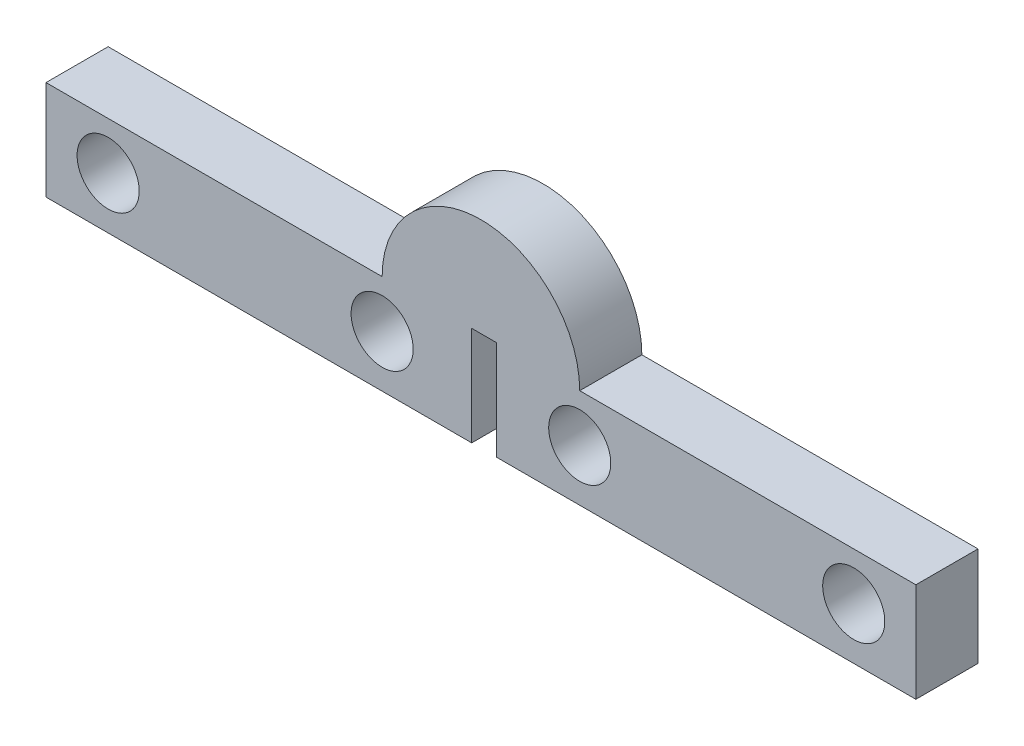
ISO-10303-21;
HEADER;
FILE_DESCRIPTION(('STEP AP214'),'2;1');
FILE_NAME('part.step','',(''),(''),'','','');
FILE_SCHEMA(('AUTOMOTIVE_DESIGN { 1 0 10303 214 1 1 1 1 }'));
ENDSEC;
DATA;
#1=APPLICATION_CONTEXT('core data for automotive mechanical design processes');
#2=APPLICATION_PROTOCOL_DEFINITION('international standard','automotive_design',2000,#1);
#3=PRODUCT_CONTEXT('',#1,'mechanical');
#4=PRODUCT('Part','Part','',(#3));
#5=PRODUCT_RELATED_PRODUCT_CATEGORY('part','',(#4));
#6=PRODUCT_DEFINITION_FORMATION('','',#4);
#7=PRODUCT_DEFINITION_CONTEXT('part definition',#1,'design');
#8=PRODUCT_DEFINITION('design','',#6,#7);
#9=PRODUCT_DEFINITION_SHAPE('','',#8);
#10=(LENGTH_UNIT() NAMED_UNIT(*) SI_UNIT(.MILLI.,.METRE.));
#11=(NAMED_UNIT(*) PLANE_ANGLE_UNIT() SI_UNIT($,.RADIAN.));
#12=(NAMED_UNIT(*) SI_UNIT($,.STERADIAN.) SOLID_ANGLE_UNIT());
#13=UNCERTAINTY_MEASURE_WITH_UNIT(LENGTH_MEASURE(1.E-05),#10,'distance_accuracy_value','');
#14=(GEOMETRIC_REPRESENTATION_CONTEXT(3) GLOBAL_UNCERTAINTY_ASSIGNED_CONTEXT((#13)) GLOBAL_UNIT_ASSIGNED_CONTEXT((#10,
#11,#12)) REPRESENTATION_CONTEXT('',''));
#15=CARTESIAN_POINT('',(0.,0.,0.));
#16=DIRECTION('',(0.,0.,1.));
#17=DIRECTION('',(1.,0.,0.));
#18=AXIS2_PLACEMENT_3D('',#15,#16,#17);
#19=CARTESIAN_POINT('',(21.,4.79,3.));
#20=DIRECTION('',(0.,0.,1.));
#21=DIRECTION('',(1.,0.,0.));
#22=AXIS2_PLACEMENT_3D('',#19,#20,#21);
#23=PLANE('',#22);
#24=DIRECTION('',(0.,1.,0.));
#25=VECTOR('',#24,1.);
#26=CARTESIAN_POINT('',(21.745,0.,3.));
#27=LINE('',#26,#25);
#28=CARTESIAN_POINT('',(21.745,0.,3.));
#29=VERTEX_POINT('',#28);
#30=CARTESIAN_POINT('',(21.745,4.79,3.));
#31=VERTEX_POINT('',#30);
#32=EDGE_CURVE('E181',#29,#31,#27,.T.);
#33=ORIENTED_EDGE('',*,*,#32,.F.);
#34=DIRECTION('',(-1.,0.,0.));
#35=VECTOR('',#34,1.);
#36=CARTESIAN_POINT('',(42.,0.,3.));
#37=LINE('',#36,#35);
#38=CARTESIAN_POINT('',(42.,0.,3.));
#39=VERTEX_POINT('',#38);
#40=EDGE_CURVE('E215',#39,#29,#37,.T.);
#41=ORIENTED_EDGE('',*,*,#40,.F.);
#42=DIRECTION('',(0.,-1.,0.));
#43=VECTOR('',#42,1.);
#44=CARTESIAN_POINT('',(42.,0.,3.));
#45=LINE('',#44,#43);
#46=CARTESIAN_POINT('',(42.,4.79,3.));
#47=VERTEX_POINT('',#46);
#48=EDGE_CURVE('E206',#47,#39,#45,.T.);
#49=ORIENTED_EDGE('',*,*,#48,.F.);
#50=DIRECTION('',(1.,0.,0.));
#51=VECTOR('',#50,1.);
#52=CARTESIAN_POINT('',(42.,4.79,3.));
#53=LINE('',#52,#51);
#54=CARTESIAN_POINT('',(25.77,4.79,3.));
#55=VERTEX_POINT('',#54);
#56=EDGE_CURVE('E210',#55,#47,#53,.T.);
#57=ORIENTED_EDGE('',*,*,#56,.F.);
#58=CARTESIAN_POINT('',(21.,4.79,3.));
#59=DIRECTION('',(0.,0.,1.));
#60=DIRECTION('',(1.,0.,0.));
#61=AXIS2_PLACEMENT_3D('',#58,#59,#60);
#62=CIRCLE('',#61,4.76999999999999);
#63=CARTESIAN_POINT('',(16.23,4.79,3.));
#64=VERTEX_POINT('',#63);
#65=EDGE_CURVE('E132',#55,#64,#62,.T.);
#66=ORIENTED_EDGE('',*,*,#65,.T.);
#67=DIRECTION('',(-1.,0.,0.));
#68=VECTOR('',#67,1.);
#69=CARTESIAN_POINT('',(0.,4.79,3.));
#70=LINE('',#69,#68);
#71=CARTESIAN_POINT('',(0.,4.79,3.));
#72=VERTEX_POINT('',#71);
#73=EDGE_CURVE('E63',#64,#72,#70,.T.);
#74=ORIENTED_EDGE('',*,*,#73,.T.);
#75=DIRECTION('',(0.,-1.,0.));
#76=VECTOR('',#75,1.);
#77=CARTESIAN_POINT('',(0.,0.,3.));
#78=LINE('',#77,#76);
#79=CARTESIAN_POINT('',(0.,0.,3.));
#80=VERTEX_POINT('',#79);
#81=EDGE_CURVE('E159',#72,#80,#78,.T.);
#82=ORIENTED_EDGE('',*,*,#81,.T.);
#83=DIRECTION('',(1.,0.,0.));
#84=VECTOR('',#83,1.);
#85=CARTESIAN_POINT('',(0.,0.,3.));
#86=LINE('',#85,#84);
#87=CARTESIAN_POINT('',(20.555,0.,3.));
#88=VERTEX_POINT('',#87);
#89=EDGE_CURVE('E96',#80,#88,#86,.T.);
#90=ORIENTED_EDGE('',*,*,#89,.T.);
#91=DIRECTION('',(0.,1.,0.));
#92=VECTOR('',#91,1.);
#93=CARTESIAN_POINT('',(20.555,4.79,3.));
#94=LINE('',#93,#92);
#95=CARTESIAN_POINT('',(20.555,4.79,3.));
#96=VERTEX_POINT('',#95);
#97=EDGE_CURVE('E104',#88,#96,#94,.T.);
#98=ORIENTED_EDGE('',*,*,#97,.T.);
#99=DIRECTION('',(1.,0.,0.));
#100=VECTOR('',#99,1.);
#101=CARTESIAN_POINT('',(20.555,4.79,3.));
#102=LINE('',#101,#100);
#103=EDGE_CURVE('E110',#96,#31,#102,.T.);
#104=ORIENTED_EDGE('',*,*,#103,.T.);
#105=EDGE_LOOP('',(#33,#41,#49,#57,#66,#74,#82,#90,#98,#104));
#106=FACE_BOUND('',#105,.T.);
#107=CARTESIAN_POINT('',(3.,2.5,3.));
#108=DIRECTION('',(0.,0.,1.));
#109=DIRECTION('',(1.,0.,0.));
#110=AXIS2_PLACEMENT_3D('',#107,#108,#109);
#111=CIRCLE('',#110,1.5);
#112=CARTESIAN_POINT('',(4.5,2.5,3.));
#113=VERTEX_POINT('',#112);
#114=EDGE_CURVE('E146',#113,#113,#111,.T.);
#115=ORIENTED_EDGE('',*,*,#114,.F.);
#116=EDGE_LOOP('',(#115));
#117=FACE_BOUND('',#116,.T.);
#118=CARTESIAN_POINT('',(16.23,2.5,3.));
#119=DIRECTION('',(0.,0.,1.));
#120=DIRECTION('',(1.,0.,0.));
#121=AXIS2_PLACEMENT_3D('',#118,#119,#120);
#122=CIRCLE('',#121,1.5);
#123=CARTESIAN_POINT('',(17.73,2.5,3.));
#124=VERTEX_POINT('',#123);
#125=EDGE_CURVE('E241',#124,#124,#122,.T.);
#126=ORIENTED_EDGE('',*,*,#125,.F.);
#127=EDGE_LOOP('',(#126));
#128=FACE_BOUND('',#127,.T.);
#129=CARTESIAN_POINT('',(25.77,2.5,3.));
#130=DIRECTION('',(0.,0.,-1.));
#131=DIRECTION('',(-1.,0.,0.));
#132=AXIS2_PLACEMENT_3D('',#129,#130,#131);
#133=CIRCLE('',#132,1.5);
#134=CARTESIAN_POINT('',(24.27,2.5,3.));
#135=VERTEX_POINT('',#134);
#136=EDGE_CURVE('E190',#135,#135,#133,.T.);
#137=ORIENTED_EDGE('',*,*,#136,.T.);
#138=EDGE_LOOP('',(#137));
#139=FACE_BOUND('',#138,.T.);
#140=CARTESIAN_POINT('',(39.,2.5,3.));
#141=DIRECTION('',(0.,0.,-1.));
#142=DIRECTION('',(-1.,0.,0.));
#143=AXIS2_PLACEMENT_3D('',#140,#141,#142);
#144=CIRCLE('',#143,1.5);
#145=CARTESIAN_POINT('',(37.5,2.5,3.));
#146=VERTEX_POINT('',#145);
#147=EDGE_CURVE('E198',#146,#146,#144,.T.);
#148=ORIENTED_EDGE('',*,*,#147,.T.);
#149=EDGE_LOOP('',(#148));
#150=FACE_BOUND('',#149,.T.);
#151=ADVANCED_FACE('F39',(#106,#117,#128,#139,#150),#23,.T.);
#152=CARTESIAN_POINT('',(21.,4.79,0.));
#153=DIRECTION('',(0.,0.,1.));
#154=DIRECTION('',(1.,0.,0.));
#155=AXIS2_PLACEMENT_3D('',#152,#153,#154);
#156=PLANE('',#155);
#157=DIRECTION('',(-1.,0.,0.));
#158=VECTOR('',#157,1.);
#159=CARTESIAN_POINT('',(42.,0.,0.));
#160=LINE('',#159,#158);
#161=CARTESIAN_POINT('',(42.,0.,0.));
#162=VERTEX_POINT('',#161);
#163=CARTESIAN_POINT('',(21.745,0.,0.));
#164=VERTEX_POINT('',#163);
#165=EDGE_CURVE('E211',#162,#164,#160,.T.);
#166=ORIENTED_EDGE('',*,*,#165,.T.);
#167=DIRECTION('',(0.,1.,0.));
#168=VECTOR('',#167,1.);
#169=CARTESIAN_POINT('',(21.745,4.79,0.));
#170=LINE('',#169,#168);
#171=CARTESIAN_POINT('',(21.745,4.79,0.));
#172=VERTEX_POINT('',#171);
#173=EDGE_CURVE('E54',#164,#172,#170,.T.);
#174=ORIENTED_EDGE('',*,*,#173,.T.);
#175=DIRECTION('',(1.,0.,0.));
#176=VECTOR('',#175,1.);
#177=CARTESIAN_POINT('',(20.555,4.79,0.));
#178=LINE('',#177,#176);
#179=CARTESIAN_POINT('',(20.555,4.79,0.));
#180=VERTEX_POINT('',#179);
#181=EDGE_CURVE('E151',#180,#172,#178,.T.);
#182=ORIENTED_EDGE('',*,*,#181,.F.);
#183=DIRECTION('',(0.,1.,0.));
#184=VECTOR('',#183,1.);
#185=CARTESIAN_POINT('',(20.555,4.79,0.));
#186=LINE('',#185,#184);
#187=CARTESIAN_POINT('',(20.555,0.,0.));
#188=VERTEX_POINT('',#187);
#189=EDGE_CURVE('E120',#188,#180,#186,.T.);
#190=ORIENTED_EDGE('',*,*,#189,.F.);
#191=DIRECTION('',(1.,0.,0.));
#192=VECTOR('',#191,1.);
#193=CARTESIAN_POINT('',(0.,0.,0.));
#194=LINE('',#193,#192);
#195=CARTESIAN_POINT('',(0.,0.,0.));
#196=VERTEX_POINT('',#195);
#197=EDGE_CURVE('E145',#196,#188,#194,.T.);
#198=ORIENTED_EDGE('',*,*,#197,.F.);
#199=DIRECTION('',(0.,-1.,0.));
#200=VECTOR('',#199,1.);
#201=CARTESIAN_POINT('',(0.,0.,0.));
#202=LINE('',#201,#200);
#203=CARTESIAN_POINT('',(0.,4.79,0.));
#204=VERTEX_POINT('',#203);
#205=EDGE_CURVE('E141',#204,#196,#202,.T.);
#206=ORIENTED_EDGE('',*,*,#205,.F.);
#207=DIRECTION('',(-1.,0.,0.));
#208=VECTOR('',#207,1.);
#209=CARTESIAN_POINT('',(0.,4.79,0.));
#210=LINE('',#209,#208);
#211=CARTESIAN_POINT('',(16.23,4.79,0.));
#212=VERTEX_POINT('',#211);
#213=EDGE_CURVE('E87',#212,#204,#210,.T.);
#214=ORIENTED_EDGE('',*,*,#213,.F.);
#215=CARTESIAN_POINT('',(21.,4.79,0.));
#216=DIRECTION('',(0.,0.,1.));
#217=DIRECTION('',(1.,0.,0.));
#218=AXIS2_PLACEMENT_3D('',#215,#216,#217);
#219=CIRCLE('',#218,4.76999999999999);
#220=CARTESIAN_POINT('',(25.77,4.79,0.));
#221=VERTEX_POINT('',#220);
#222=EDGE_CURVE('E154',#221,#212,#219,.T.);
#223=ORIENTED_EDGE('',*,*,#222,.F.);
#224=DIRECTION('',(1.,0.,0.));
#225=VECTOR('',#224,1.);
#226=CARTESIAN_POINT('',(42.,4.79,0.));
#227=LINE('',#226,#225);
#228=CARTESIAN_POINT('',(42.,4.79,0.));
#229=VERTEX_POINT('',#228);
#230=EDGE_CURVE('E223',#221,#229,#227,.T.);
#231=ORIENTED_EDGE('',*,*,#230,.T.);
#232=DIRECTION('',(0.,-1.,0.));
#233=VECTOR('',#232,1.);
#234=CARTESIAN_POINT('',(42.,0.,0.));
#235=LINE('',#234,#233);
#236=EDGE_CURVE('E202',#229,#162,#235,.T.);
#237=ORIENTED_EDGE('',*,*,#236,.T.);
#238=EDGE_LOOP('',(#166,#174,#182,#190,#198,#206,#214,#223,#231,#237));
#239=FACE_BOUND('',#238,.T.);
#240=CARTESIAN_POINT('',(3.,2.5,0.));
#241=DIRECTION('',(0.,0.,1.));
#242=DIRECTION('',(1.,0.,0.));
#243=AXIS2_PLACEMENT_3D('',#240,#241,#242);
#244=CIRCLE('',#243,1.5);
#245=CARTESIAN_POINT('',(4.5,2.5,0.));
#246=VERTEX_POINT('',#245);
#247=EDGE_CURVE('E245',#246,#246,#244,.T.);
#248=ORIENTED_EDGE('',*,*,#247,.T.);
#249=EDGE_LOOP('',(#248));
#250=FACE_BOUND('',#249,.T.);
#251=CARTESIAN_POINT('',(16.23,2.5,0.));
#252=DIRECTION('',(0.,0.,1.));
#253=DIRECTION('',(1.,0.,0.));
#254=AXIS2_PLACEMENT_3D('',#251,#252,#253);
#255=CIRCLE('',#254,1.5);
#256=CARTESIAN_POINT('',(17.73,2.5,0.));
#257=VERTEX_POINT('',#256);
#258=EDGE_CURVE('E240',#257,#257,#255,.T.);
#259=ORIENTED_EDGE('',*,*,#258,.T.);
#260=EDGE_LOOP('',(#259));
#261=FACE_BOUND('',#260,.T.);
#262=CARTESIAN_POINT('',(25.77,2.5,0.));
#263=DIRECTION('',(0.,0.,-1.));
#264=DIRECTION('',(-1.,0.,0.));
#265=AXIS2_PLACEMENT_3D('',#262,#263,#264);
#266=CIRCLE('',#265,1.5);
#267=CARTESIAN_POINT('',(24.27,2.5,0.));
#268=VERTEX_POINT('',#267);
#269=EDGE_CURVE('E186',#268,#268,#266,.T.);
#270=ORIENTED_EDGE('',*,*,#269,.F.);
#271=EDGE_LOOP('',(#270));
#272=FACE_BOUND('',#271,.T.);
#273=CARTESIAN_POINT('',(39.,2.5,0.));
#274=DIRECTION('',(0.,0.,-1.));
#275=DIRECTION('',(-1.,0.,0.));
#276=AXIS2_PLACEMENT_3D('',#273,#274,#275);
#277=CIRCLE('',#276,1.5);
#278=CARTESIAN_POINT('',(37.5,2.5,0.));
#279=VERTEX_POINT('',#278);
#280=EDGE_CURVE('E194',#279,#279,#277,.T.);
#281=ORIENTED_EDGE('',*,*,#280,.F.);
#282=EDGE_LOOP('',(#281));
#283=FACE_BOUND('',#282,.T.);
#284=ADVANCED_FACE('F173',(#239,#250,#261,#272,#283),#156,.F.);
#285=CARTESIAN_POINT('',(0.,0.,3.));
#286=DIRECTION('',(1.,0.,0.));
#287=DIRECTION('',(0.,0.,-1.));
#288=AXIS2_PLACEMENT_3D('',#285,#286,#287);
#289=PLANE('',#288);
#290=ORIENTED_EDGE('',*,*,#205,.T.);
#291=DIRECTION('',(0.,0.,-1.));
#292=VECTOR('',#291,1.);
#293=CARTESIAN_POINT('',(0.,0.,3.));
#294=LINE('',#293,#292);
#295=EDGE_CURVE('E48',#80,#196,#294,.T.);
#296=ORIENTED_EDGE('',*,*,#295,.F.);
#297=ORIENTED_EDGE('',*,*,#81,.F.);
#298=DIRECTION('',(0.,0.,-1.));
#299=VECTOR('',#298,1.);
#300=CARTESIAN_POINT('',(0.,4.79,3.));
#301=LINE('',#300,#299);
#302=EDGE_CURVE('E140',#72,#204,#301,.T.);
#303=ORIENTED_EDGE('',*,*,#302,.T.);
#304=EDGE_LOOP('',(#290,#296,#297,#303));
#305=FACE_BOUND('',#304,.T.);
#306=ADVANCED_FACE('F41',(#305),#289,.F.);
#307=CARTESIAN_POINT('',(0.,0.,3.));
#308=DIRECTION('',(0.,1.,0.));
#309=DIRECTION('',(0.,0.,1.));
#310=AXIS2_PLACEMENT_3D('',#307,#308,#309);
#311=PLANE('',#310);
#312=ORIENTED_EDGE('',*,*,#197,.T.);
#313=DIRECTION('',(0.,0.,-1.));
#314=VECTOR('',#313,1.);
#315=CARTESIAN_POINT('',(20.555,0.,3.));
#316=LINE('',#315,#314);
#317=EDGE_CURVE('E125',#88,#188,#316,.T.);
#318=ORIENTED_EDGE('',*,*,#317,.F.);
#319=ORIENTED_EDGE('',*,*,#89,.F.);
#320=ORIENTED_EDGE('',*,*,#295,.T.);
#321=EDGE_LOOP('',(#312,#318,#319,#320));
#322=FACE_BOUND('',#321,.T.);
#323=ADVANCED_FACE('F167',(#322),#311,.F.);
#324=CARTESIAN_POINT('',(20.555,4.79,3.));
#325=DIRECTION('',(-1.,0.,0.));
#326=DIRECTION('',(0.,0.,1.));
#327=AXIS2_PLACEMENT_3D('',#324,#325,#326);
#328=PLANE('',#327);
#329=ORIENTED_EDGE('',*,*,#189,.T.);
#330=DIRECTION('',(0.,0.,-1.));
#331=VECTOR('',#330,1.);
#332=CARTESIAN_POINT('',(20.555,4.79,3.));
#333=LINE('',#332,#331);
#334=EDGE_CURVE('E117',#96,#180,#333,.T.);
#335=ORIENTED_EDGE('',*,*,#334,.F.);
#336=ORIENTED_EDGE('',*,*,#97,.F.);
#337=ORIENTED_EDGE('',*,*,#317,.T.);
#338=EDGE_LOOP('',(#329,#335,#336,#337));
#339=FACE_BOUND('',#338,.T.);
#340=ADVANCED_FACE('F118',(#339),#328,.F.);
#341=CARTESIAN_POINT('',(20.555,4.79,3.));
#342=DIRECTION('',(0.,1.,0.));
#343=DIRECTION('',(0.,0.,1.));
#344=AXIS2_PLACEMENT_3D('',#341,#342,#343);
#345=PLANE('',#344);
#346=ORIENTED_EDGE('',*,*,#181,.T.);
#347=DIRECTION('',(0.,0.,1.));
#348=VECTOR('',#347,1.);
#349=CARTESIAN_POINT('',(21.745,4.79,-7.));
#350=LINE('',#349,#348);
#351=EDGE_CURVE('E129',#172,#31,#350,.T.);
#352=ORIENTED_EDGE('',*,*,#351,.T.);
#353=ORIENTED_EDGE('',*,*,#103,.F.);
#354=ORIENTED_EDGE('',*,*,#334,.T.);
#355=EDGE_LOOP('',(#346,#352,#353,#354));
#356=FACE_BOUND('',#355,.T.);
#357=ADVANCED_FACE('F128',(#356),#345,.F.);
#358=CARTESIAN_POINT('',(21.,4.79,3.));
#359=DIRECTION('',(0.,0.,-1.));
#360=DIRECTION('',(-1.,0.,0.));
#361=AXIS2_PLACEMENT_3D('',#358,#359,#360);
#362=CYLINDRICAL_SURFACE('',#361,4.76999999999999);
#363=ORIENTED_EDGE('',*,*,#222,.T.);
#364=DIRECTION('',(0.,0.,-1.));
#365=VECTOR('',#364,1.);
#366=CARTESIAN_POINT('',(16.23,4.79,3.));
#367=LINE('',#366,#365);
#368=EDGE_CURVE('E126',#64,#212,#367,.T.);
#369=ORIENTED_EDGE('',*,*,#368,.F.);
#370=ORIENTED_EDGE('',*,*,#65,.F.);
#371=DIRECTION('',(0.,0.,-1.));
#372=VECTOR('',#371,1.);
#373=CARTESIAN_POINT('',(25.77,4.79,3.));
#374=LINE('',#373,#372);
#375=EDGE_CURVE('E232',#55,#221,#374,.T.);
#376=ORIENTED_EDGE('',*,*,#375,.T.);
#377=EDGE_LOOP('',(#363,#369,#370,#376));
#378=FACE_BOUND('',#377,.T.);
#379=ADVANCED_FACE('F273',(#378),#362,.T.);
#380=CARTESIAN_POINT('',(0.,4.79,3.));
#381=DIRECTION('',(0.,-1.,0.));
#382=DIRECTION('',(0.,0.,-1.));
#383=AXIS2_PLACEMENT_3D('',#380,#381,#382);
#384=PLANE('',#383);
#385=ORIENTED_EDGE('',*,*,#213,.T.);
#386=ORIENTED_EDGE('',*,*,#302,.F.);
#387=ORIENTED_EDGE('',*,*,#73,.F.);
#388=ORIENTED_EDGE('',*,*,#368,.T.);
#389=EDGE_LOOP('',(#385,#386,#387,#388));
#390=FACE_BOUND('',#389,.T.);
#391=ADVANCED_FACE('F263',(#390),#384,.F.);
#392=CARTESIAN_POINT('',(3.,2.5,3.));
#393=DIRECTION('',(0.,0.,-1.));
#394=DIRECTION('',(-1.,0.,0.));
#395=AXIS2_PLACEMENT_3D('',#392,#393,#394);
#396=CYLINDRICAL_SURFACE('',#395,1.5);
#397=ORIENTED_EDGE('',*,*,#114,.T.);
#398=EDGE_LOOP('',(#397));
#399=FACE_BOUND('',#398,.T.);
#400=ORIENTED_EDGE('',*,*,#247,.F.);
#401=EDGE_LOOP('',(#400));
#402=FACE_BOUND('',#401,.T.);
#403=ADVANCED_FACE('F260',(#399,#402),#396,.F.);
#404=CARTESIAN_POINT('',(16.23,2.5,3.));
#405=DIRECTION('',(0.,0.,-1.));
#406=DIRECTION('',(-1.,0.,0.));
#407=AXIS2_PLACEMENT_3D('',#404,#405,#406);
#408=CYLINDRICAL_SURFACE('',#407,1.5);
#409=ORIENTED_EDGE('',*,*,#125,.T.);
#410=EDGE_LOOP('',(#409));
#411=FACE_BOUND('',#410,.T.);
#412=ORIENTED_EDGE('',*,*,#258,.F.);
#413=EDGE_LOOP('',(#412));
#414=FACE_BOUND('',#413,.T.);
#415=ADVANCED_FACE('F262',(#411,#414),#408,.F.);
#416=CARTESIAN_POINT('',(42.,0.,3.));
#417=DIRECTION('',(1.,0.,0.));
#418=DIRECTION('',(0.,0.,-1.));
#419=AXIS2_PLACEMENT_3D('',#416,#417,#418);
#420=PLANE('',#419);
#421=ORIENTED_EDGE('',*,*,#236,.F.);
#422=DIRECTION('',(0.,0.,-1.));
#423=VECTOR('',#422,1.);
#424=CARTESIAN_POINT('',(42.,4.79,3.));
#425=LINE('',#424,#423);
#426=EDGE_CURVE('E236',#47,#229,#425,.T.);
#427=ORIENTED_EDGE('',*,*,#426,.F.);
#428=ORIENTED_EDGE('',*,*,#48,.T.);
#429=DIRECTION('',(0.,0.,-1.));
#430=VECTOR('',#429,1.);
#431=CARTESIAN_POINT('',(42.,0.,3.));
#432=LINE('',#431,#430);
#433=EDGE_CURVE('E219',#39,#162,#432,.T.);
#434=ORIENTED_EDGE('',*,*,#433,.T.);
#435=EDGE_LOOP('',(#421,#427,#428,#434));
#436=FACE_BOUND('',#435,.T.);
#437=ADVANCED_FACE('F270',(#436),#420,.T.);
#438=CARTESIAN_POINT('',(42.,4.79,3.));
#439=DIRECTION('',(0.,1.,0.));
#440=DIRECTION('',(0.,0.,1.));
#441=AXIS2_PLACEMENT_3D('',#438,#439,#440);
#442=PLANE('',#441);
#443=ORIENTED_EDGE('',*,*,#230,.F.);
#444=ORIENTED_EDGE('',*,*,#375,.F.);
#445=ORIENTED_EDGE('',*,*,#56,.T.);
#446=ORIENTED_EDGE('',*,*,#426,.T.);
#447=EDGE_LOOP('',(#443,#444,#445,#446));
#448=FACE_BOUND('',#447,.T.);
#449=ADVANCED_FACE('F322',(#448),#442,.T.);
#450=CARTESIAN_POINT('',(42.,0.,3.));
#451=DIRECTION('',(0.,-1.,0.));
#452=DIRECTION('',(0.,0.,-1.));
#453=AXIS2_PLACEMENT_3D('',#450,#451,#452);
#454=PLANE('',#453);
#455=DIRECTION('',(0.,0.,1.));
#456=VECTOR('',#455,1.);
#457=CARTESIAN_POINT('',(21.745,0.,3.));
#458=LINE('',#457,#456);
#459=EDGE_CURVE('E11',#164,#29,#458,.T.);
#460=ORIENTED_EDGE('',*,*,#459,.F.);
#461=ORIENTED_EDGE('',*,*,#165,.F.);
#462=ORIENTED_EDGE('',*,*,#433,.F.);
#463=ORIENTED_EDGE('',*,*,#40,.T.);
#464=EDGE_LOOP('',(#460,#461,#462,#463));
#465=FACE_BOUND('',#464,.T.);
#466=ADVANCED_FACE('F316',(#465),#454,.T.);
#467=CARTESIAN_POINT('',(39.,2.5,3.));
#468=DIRECTION('',(0.,0.,-1.));
#469=DIRECTION('',(-1.,0.,0.));
#470=AXIS2_PLACEMENT_3D('',#467,#468,#469);
#471=CYLINDRICAL_SURFACE('',#470,1.5);
#472=ORIENTED_EDGE('',*,*,#147,.F.);
#473=EDGE_LOOP('',(#472));
#474=FACE_BOUND('',#473,.T.);
#475=ORIENTED_EDGE('',*,*,#280,.T.);
#476=EDGE_LOOP('',(#475));
#477=FACE_BOUND('',#476,.T.);
#478=ADVANCED_FACE('F321',(#474,#477),#471,.F.);
#479=CARTESIAN_POINT('',(25.77,2.5,3.));
#480=DIRECTION('',(0.,0.,-1.));
#481=DIRECTION('',(-1.,0.,0.));
#482=AXIS2_PLACEMENT_3D('',#479,#480,#481);
#483=CYLINDRICAL_SURFACE('',#482,1.5);
#484=ORIENTED_EDGE('',*,*,#136,.F.);
#485=EDGE_LOOP('',(#484));
#486=FACE_BOUND('',#485,.T.);
#487=ORIENTED_EDGE('',*,*,#269,.T.);
#488=EDGE_LOOP('',(#487));
#489=FACE_BOUND('',#488,.T.);
#490=ADVANCED_FACE('F334',(#486,#489),#483,.F.);
#491=CARTESIAN_POINT('',(21.745,0.,-7.));
#492=DIRECTION('',(1.,0.,0.));
#493=DIRECTION('',(0.,0.,-1.));
#494=AXIS2_PLACEMENT_3D('',#491,#492,#493);
#495=PLANE('',#494);
#496=ORIENTED_EDGE('',*,*,#459,.T.);
#497=ORIENTED_EDGE('',*,*,#32,.T.);
#498=ORIENTED_EDGE('',*,*,#351,.F.);
#499=ORIENTED_EDGE('',*,*,#173,.F.);
#500=EDGE_LOOP('',(#496,#497,#498,#499));
#501=FACE_BOUND('',#500,.T.);
#502=ADVANCED_FACE('F180',(#501),#495,.F.);
#503=CLOSED_SHELL('',(#151,#284,#306,#323,#340,#357,#379,#391,#403,#415,#437,#449,#466,#478,
#490,#502));
#504=MANIFOLD_SOLID_BREP('B2',#503);
#505=ADVANCED_BREP_SHAPE_REPRESENTATION('',(#18,#504),#14);
#506=SHAPE_DEFINITION_REPRESENTATION(#9,#505);
ENDSEC;
END-ISO-10303-21;
